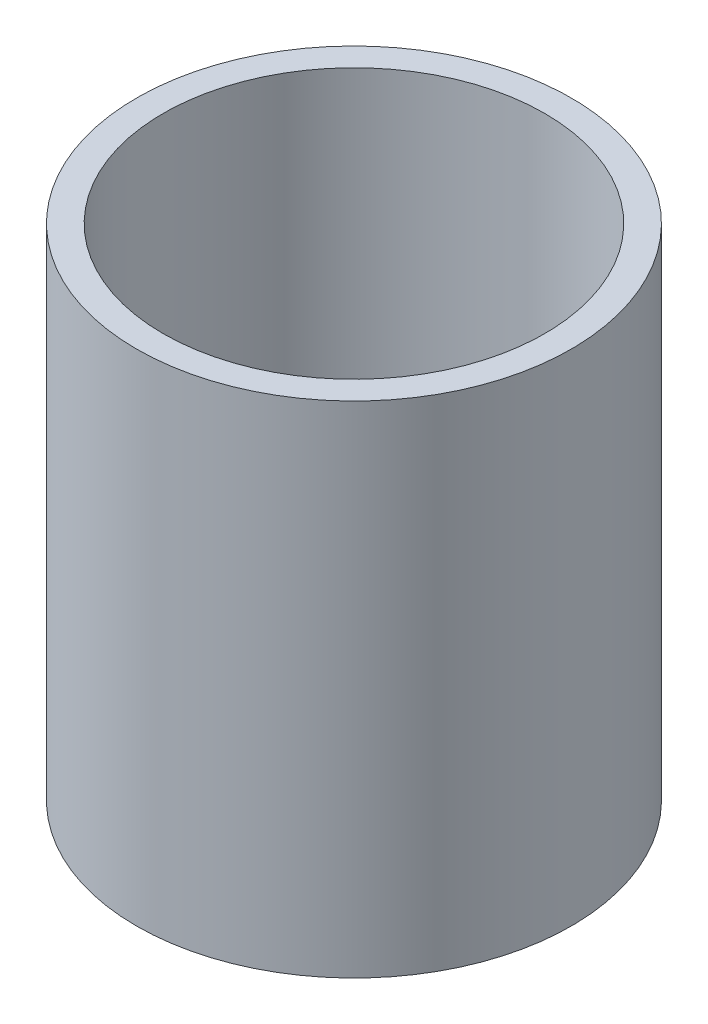
ISO-10303-21;
HEADER;
FILE_DESCRIPTION(('STEP AP214'),'2;1');
FILE_NAME('part.step','',(''),(''),'','','');
FILE_SCHEMA(('AUTOMOTIVE_DESIGN { 1 0 10303 214 1 1 1 1 }'));
ENDSEC;
DATA;
#1=APPLICATION_CONTEXT('core data for automotive mechanical design processes');
#2=APPLICATION_PROTOCOL_DEFINITION('international standard','automotive_design',2000,#1);
#3=PRODUCT_CONTEXT('',#1,'mechanical');
#4=PRODUCT('Part','Part','',(#3));
#5=PRODUCT_RELATED_PRODUCT_CATEGORY('part','',(#4));
#6=PRODUCT_DEFINITION_FORMATION('','',#4);
#7=PRODUCT_DEFINITION_CONTEXT('part definition',#1,'design');
#8=PRODUCT_DEFINITION('design','',#6,#7);
#9=PRODUCT_DEFINITION_SHAPE('','',#8);
#10=(LENGTH_UNIT() NAMED_UNIT(*) SI_UNIT(.MILLI.,.METRE.));
#11=(NAMED_UNIT(*) PLANE_ANGLE_UNIT() SI_UNIT($,.RADIAN.));
#12=(NAMED_UNIT(*) SI_UNIT($,.STERADIAN.) SOLID_ANGLE_UNIT());
#13=UNCERTAINTY_MEASURE_WITH_UNIT(LENGTH_MEASURE(1.E-05),#10,'distance_accuracy_value','');
#14=(GEOMETRIC_REPRESENTATION_CONTEXT(3) GLOBAL_UNCERTAINTY_ASSIGNED_CONTEXT((#13)) GLOBAL_UNIT_ASSIGNED_CONTEXT((#10,
#11,#12)) REPRESENTATION_CONTEXT('',''));
#15=CARTESIAN_POINT('',(0.,0.,0.));
#16=DIRECTION('',(0.,0.,1.));
#17=DIRECTION('',(1.,0.,0.));
#18=AXIS2_PLACEMENT_3D('',#15,#16,#17);
#19=CARTESIAN_POINT('',(0.,63.2035587166568,0.));
#20=DIRECTION('',(0.,-1.,0.));
#21=DIRECTION('',(0.,0.,-1.));
#22=AXIS2_PLACEMENT_3D('',#19,#20,#21);
#23=CYLINDRICAL_SURFACE('',#22,27.5);
#24=CARTESIAN_POINT('',(0.,63.2035587166568,0.));
#25=DIRECTION('',(0.,1.,0.));
#26=DIRECTION('',(0.,0.,1.));
#27=AXIS2_PLACEMENT_3D('',#24,#25,#26);
#28=CIRCLE('',#27,27.5);
#29=CARTESIAN_POINT('',(0.,63.2035587166568,27.5));
#30=VERTEX_POINT('',#29);
#31=EDGE_CURVE('E10',#30,#30,#28,.T.);
#32=ORIENTED_EDGE('',*,*,#31,.F.);
#33=EDGE_LOOP('',(#32));
#34=FACE_BOUND('',#33,.T.);
#35=CARTESIAN_POINT('',(0.,0.,0.));
#36=DIRECTION('',(0.,1.,0.));
#37=DIRECTION('',(0.,0.,1.));
#38=AXIS2_PLACEMENT_3D('',#35,#36,#37);
#39=CIRCLE('',#38,27.5);
#40=CARTESIAN_POINT('',(0.,0.,27.5));
#41=VERTEX_POINT('',#40);
#42=EDGE_CURVE('E37',#41,#41,#39,.T.);
#43=ORIENTED_EDGE('',*,*,#42,.T.);
#44=EDGE_LOOP('',(#43));
#45=FACE_BOUND('',#44,.T.);
#46=ADVANCED_FACE('F40',(#34,#45),#23,.T.);
#47=CARTESIAN_POINT('',(0.,63.2035587166568,0.));
#48=DIRECTION('',(0.,1.,0.));
#49=DIRECTION('',(0.,0.,1.));
#50=AXIS2_PLACEMENT_3D('',#47,#48,#49);
#51=PLANE('',#50);
#52=CARTESIAN_POINT('',(0.,63.2035587166568,0.));
#53=DIRECTION('',(0.,1.,0.));
#54=DIRECTION('',(0.,0.,1.));
#55=AXIS2_PLACEMENT_3D('',#52,#53,#54);
#56=CIRCLE('',#55,24.1297375807062);
#57=CARTESIAN_POINT('',(0.,63.2035587166568,24.1297375807062));
#58=VERTEX_POINT('',#57);
#59=EDGE_CURVE('E50',#58,#58,#56,.T.);
#60=ORIENTED_EDGE('',*,*,#59,.F.);
#61=EDGE_LOOP('',(#60));
#62=FACE_BOUND('',#61,.T.);
#63=ORIENTED_EDGE('',*,*,#31,.T.);
#64=EDGE_LOOP('',(#63));
#65=FACE_BOUND('',#64,.T.);
#66=ADVANCED_FACE('F59',(#62,#65),#51,.T.);
#67=CARTESIAN_POINT('',(0.,0.,0.));
#68=DIRECTION('',(0.,1.,0.));
#69=DIRECTION('',(0.,0.,1.));
#70=AXIS2_PLACEMENT_3D('',#67,#68,#69);
#71=PLANE('',#70);
#72=CARTESIAN_POINT('',(0.,0.,0.));
#73=DIRECTION('',(0.,1.,0.));
#74=DIRECTION('',(0.,0.,1.));
#75=AXIS2_PLACEMENT_3D('',#72,#73,#74);
#76=CIRCLE('',#75,24.1297375807062);
#77=CARTESIAN_POINT('',(0.,0.,24.1297375807062));
#78=VERTEX_POINT('',#77);
#79=EDGE_CURVE('E47',#78,#78,#76,.T.);
#80=ORIENTED_EDGE('',*,*,#79,.T.);
#81=EDGE_LOOP('',(#80));
#82=FACE_BOUND('',#81,.T.);
#83=ORIENTED_EDGE('',*,*,#42,.F.);
#84=EDGE_LOOP('',(#83));
#85=FACE_BOUND('',#84,.T.);
#86=ADVANCED_FACE('F58',(#82,#85),#71,.F.);
#87=CARTESIAN_POINT('',(0.,63.2035587166568,0.));
#88=DIRECTION('',(0.,-1.,0.));
#89=DIRECTION('',(0.,0.,-1.));
#90=AXIS2_PLACEMENT_3D('',#87,#88,#89);
#91=CYLINDRICAL_SURFACE('',#90,24.1297375807062);
#92=ORIENTED_EDGE('',*,*,#59,.T.);
#93=EDGE_LOOP('',(#92));
#94=FACE_BOUND('',#93,.T.);
#95=ORIENTED_EDGE('',*,*,#79,.F.);
#96=EDGE_LOOP('',(#95));
#97=FACE_BOUND('',#96,.T.);
#98=ADVANCED_FACE('F54',(#94,#97),#91,.F.);
#99=CLOSED_SHELL('',(#46,#66,#86,#98));
#100=MANIFOLD_SOLID_BREP('B2',#99);
#101=ADVANCED_BREP_SHAPE_REPRESENTATION('',(#18,#100),#14);
#102=SHAPE_DEFINITION_REPRESENTATION(#9,#101);
ENDSEC;
END-ISO-10303-21;
